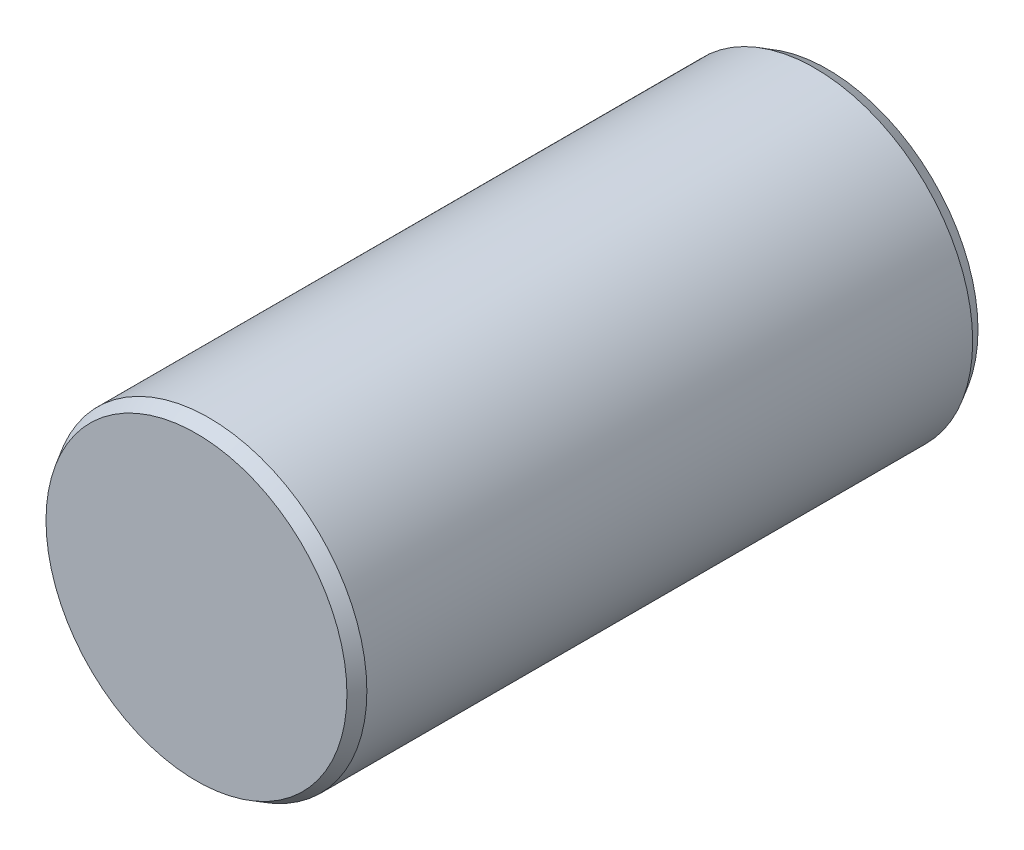
ISO-10303-21;
HEADER;
FILE_DESCRIPTION(('STEP AP214'),'2;1');
FILE_NAME('part.step','',(''),(''),'','','');
FILE_SCHEMA(('AUTOMOTIVE_DESIGN { 1 0 10303 214 1 1 1 1 }'));
ENDSEC;
DATA;
#1=APPLICATION_CONTEXT('core data for automotive mechanical design processes');
#2=APPLICATION_PROTOCOL_DEFINITION('international standard','automotive_design',2000,#1);
#3=PRODUCT_CONTEXT('',#1,'mechanical');
#4=PRODUCT('Part','Part','',(#3));
#5=PRODUCT_RELATED_PRODUCT_CATEGORY('part','',(#4));
#6=PRODUCT_DEFINITION_FORMATION('','',#4);
#7=PRODUCT_DEFINITION_CONTEXT('part definition',#1,'design');
#8=PRODUCT_DEFINITION('design','',#6,#7);
#9=PRODUCT_DEFINITION_SHAPE('','',#8);
#10=(LENGTH_UNIT() NAMED_UNIT(*) SI_UNIT(.MILLI.,.METRE.));
#11=(NAMED_UNIT(*) PLANE_ANGLE_UNIT() SI_UNIT($,.RADIAN.));
#12=(NAMED_UNIT(*) SI_UNIT($,.STERADIAN.) SOLID_ANGLE_UNIT());
#13=UNCERTAINTY_MEASURE_WITH_UNIT(LENGTH_MEASURE(1.E-05),#10,'distance_accuracy_value','');
#14=(GEOMETRIC_REPRESENTATION_CONTEXT(3) GLOBAL_UNCERTAINTY_ASSIGNED_CONTEXT((#13)) GLOBAL_UNIT_ASSIGNED_CONTEXT((#10,
#11,#12)) REPRESENTATION_CONTEXT('',''));
#15=CARTESIAN_POINT('',(0.,0.,0.));
#16=DIRECTION('',(0.,0.,1.));
#17=DIRECTION('',(1.,0.,0.));
#18=AXIS2_PLACEMENT_3D('',#15,#16,#17);
#19=CARTESIAN_POINT('',(0.,0.,5.));
#20=DIRECTION('',(0.,0.,-1.));
#21=DIRECTION('',(-1.,0.,0.));
#22=AXIS2_PLACEMENT_3D('',#19,#20,#21);
#23=CYLINDRICAL_SURFACE('',#22,2.5);
#24=CARTESIAN_POINT('',(0.,0.,-4.8));
#25=DIRECTION('',(0.,0.,1.));
#26=DIRECTION('',(1.,0.,0.));
#27=AXIS2_PLACEMENT_3D('',#24,#25,#26);
#28=CIRCLE('',#27,2.5);
#29=CARTESIAN_POINT('',(2.5,0.,-4.8));
#30=VERTEX_POINT('',#29);
#31=EDGE_CURVE('E42',#30,#30,#28,.T.);
#32=ORIENTED_EDGE('',*,*,#31,.T.);
#33=EDGE_LOOP('',(#32));
#34=FACE_BOUND('',#33,.T.);
#35=CARTESIAN_POINT('',(0.,0.,4.8));
#36=DIRECTION('',(0.,0.,1.));
#37=DIRECTION('',(1.,0.,0.));
#38=AXIS2_PLACEMENT_3D('',#35,#36,#37);
#39=CIRCLE('',#38,2.5);
#40=CARTESIAN_POINT('',(2.5,0.,4.8));
#41=VERTEX_POINT('',#40);
#42=EDGE_CURVE('E46',#41,#41,#39,.F.);
#43=ORIENTED_EDGE('',*,*,#42,.T.);
#44=EDGE_LOOP('',(#43));
#45=FACE_BOUND('',#44,.T.);
#46=ADVANCED_FACE('F31',(#34,#45),#23,.T.);
#47=CARTESIAN_POINT('',(0.,0.,5.));
#48=DIRECTION('',(0.,0.,1.));
#49=DIRECTION('',(1.,0.,0.));
#50=AXIS2_PLACEMENT_3D('',#47,#48,#49);
#51=PLANE('',#50);
#52=CARTESIAN_POINT('',(0.,0.,5.));
#53=DIRECTION('',(0.,0.,1.));
#54=DIRECTION('',(1.,0.,0.));
#55=AXIS2_PLACEMENT_3D('',#52,#53,#54);
#56=CIRCLE('',#55,2.38452994616207);
#57=CARTESIAN_POINT('',(2.38452994616207,0.,5.));
#58=VERTEX_POINT('',#57);
#59=EDGE_CURVE('E10',#58,#58,#56,.T.);
#60=ORIENTED_EDGE('',*,*,#59,.T.);
#61=EDGE_LOOP('',(#60));
#62=FACE_BOUND('',#61,.T.);
#63=ADVANCED_FACE('F62',(#62),#51,.T.);
#64=CARTESIAN_POINT('',(0.,0.,-5.));
#65=DIRECTION('',(0.,0.,1.));
#66=DIRECTION('',(1.,0.,0.));
#67=AXIS2_PLACEMENT_3D('',#64,#65,#66);
#68=PLANE('',#67);
#69=CARTESIAN_POINT('',(0.,0.,-5.));
#70=DIRECTION('',(0.,0.,1.));
#71=DIRECTION('',(1.,0.,0.));
#72=AXIS2_PLACEMENT_3D('',#69,#70,#71);
#73=CIRCLE('',#72,2.38452994616207);
#74=CARTESIAN_POINT('',(2.38452994616207,0.,-5.));
#75=VERTEX_POINT('',#74);
#76=EDGE_CURVE('E38',#75,#75,#73,.F.);
#77=ORIENTED_EDGE('',*,*,#76,.T.);
#78=EDGE_LOOP('',(#77));
#79=FACE_BOUND('',#78,.T.);
#80=ADVANCED_FACE('F59',(#79),#68,.F.);
#81=CARTESIAN_POINT('',(0.,0.,-4.8));
#82=DIRECTION('',(0.,0.,1.));
#83=DIRECTION('',(1.,0.,0.));
#84=AXIS2_PLACEMENT_3D('',#81,#82,#83);
#85=CONICAL_SURFACE('',#84,2.5,0.523598775598298);
#86=ORIENTED_EDGE('',*,*,#76,.F.);
#87=EDGE_LOOP('',(#86));
#88=FACE_BOUND('',#87,.T.);
#89=ORIENTED_EDGE('',*,*,#31,.F.);
#90=EDGE_LOOP('',(#89));
#91=FACE_BOUND('',#90,.T.);
#92=ADVANCED_FACE('F55',(#88,#91),#85,.T.);
#93=CARTESIAN_POINT('',(0.,0.,5.));
#94=DIRECTION('',(0.,0.,-1.));
#95=DIRECTION('',(-1.,0.,0.));
#96=AXIS2_PLACEMENT_3D('',#93,#94,#95);
#97=CONICAL_SURFACE('',#96,2.38452994616207,0.523598775598298);
#98=ORIENTED_EDGE('',*,*,#42,.F.);
#99=EDGE_LOOP('',(#98));
#100=FACE_BOUND('',#99,.T.);
#101=ORIENTED_EDGE('',*,*,#59,.F.);
#102=EDGE_LOOP('',(#101));
#103=FACE_BOUND('',#102,.T.);
#104=ADVANCED_FACE('F33',(#100,#103),#97,.T.);
#105=CLOSED_SHELL('',(#46,#63,#80,#92,#104));
#106=MANIFOLD_SOLID_BREP('B2',#105);
#107=ADVANCED_BREP_SHAPE_REPRESENTATION('',(#18,#106),#14);
#108=SHAPE_DEFINITION_REPRESENTATION(#9,#107);
ENDSEC;
END-ISO-10303-21;
